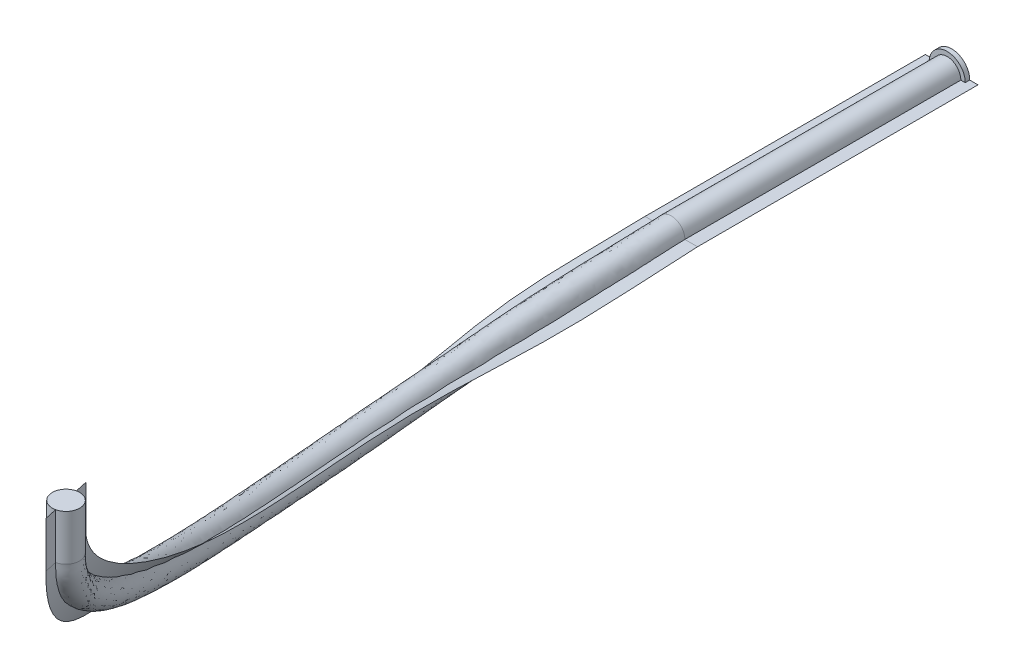
ISO-10303-21;
HEADER;
FILE_DESCRIPTION(('STEP AP214'),'2;1');
FILE_NAME('part.step','',(''),(''),'','','');
FILE_SCHEMA(('AUTOMOTIVE_DESIGN { 1 0 10303 214 1 1 1 1 }'));
ENDSEC;
DATA;
#1=APPLICATION_CONTEXT('core data for automotive mechanical design processes');
#2=APPLICATION_PROTOCOL_DEFINITION('international standard','automotive_design',2000,#1);
#3=PRODUCT_CONTEXT('',#1,'mechanical');
#4=PRODUCT('Part','Part','',(#3));
#5=PRODUCT_RELATED_PRODUCT_CATEGORY('part','',(#4));
#6=PRODUCT_DEFINITION_FORMATION('','',#4);
#7=PRODUCT_DEFINITION_CONTEXT('part definition',#1,'design');
#8=PRODUCT_DEFINITION('design','',#6,#7);
#9=PRODUCT_DEFINITION_SHAPE('','',#8);
#10=(LENGTH_UNIT() NAMED_UNIT(*) SI_UNIT(.MILLI.,.METRE.));
#11=(NAMED_UNIT(*) PLANE_ANGLE_UNIT() SI_UNIT($,.RADIAN.));
#12=(NAMED_UNIT(*) SI_UNIT($,.STERADIAN.) SOLID_ANGLE_UNIT());
#13=UNCERTAINTY_MEASURE_WITH_UNIT(LENGTH_MEASURE(1.E-05),#10,'distance_accuracy_value','');
#14=(GEOMETRIC_REPRESENTATION_CONTEXT(3) GLOBAL_UNCERTAINTY_ASSIGNED_CONTEXT((#13)) GLOBAL_UNIT_ASSIGNED_CONTEXT((#10,
#11,#12)) REPRESENTATION_CONTEXT('',''));
#15=CARTESIAN_POINT('',(0.,0.,0.));
#16=DIRECTION('',(0.,0.,1.));
#17=DIRECTION('',(1.,0.,0.));
#18=AXIS2_PLACEMENT_3D('',#15,#16,#17);
#19=CARTESIAN_POINT('',(-395.549654156341,-1278.63868879363,-202.079208570186));
#20=DIRECTION('',(0.,0.,-1.));
#21=DIRECTION('',(-1.,0.,0.));
#22=AXIS2_PLACEMENT_3D('',#19,#20,#21);
#23=CYLINDRICAL_SURFACE('',#22,15.0993824413652);
#24=CARTESIAN_POINT('',(-395.549654156341,-1278.63868879363,-202.079208570186));
#25=DIRECTION('',(0.,0.,-1.));
#26=DIRECTION('',(-1.,0.,0.));
#27=AXIS2_PLACEMENT_3D('',#24,#25,#26);
#28=CIRCLE('',#27,15.0993824413652);
#29=CARTESIAN_POINT('',(-410.649036597706,-1278.63868879363,-202.079208570186));
#30=VERTEX_POINT('',#29);
#31=EDGE_CURVE('E222',#30,#30,#28,.T.);
#32=ORIENTED_EDGE('',*,*,#31,.T.);
#33=EDGE_LOOP('',(#32));
#34=FACE_BOUND('',#33,.T.);
#35=CARTESIAN_POINT('',(-395.549654156341,-1278.63868879363,-507.499999999996));
#36=DIRECTION('',(0.,0.,-1.));
#37=DIRECTION('',(-1.,0.,0.));
#38=AXIS2_PLACEMENT_3D('',#35,#36,#37);
#39=CIRCLE('',#38,15.0993824413652);
#40=CARTESIAN_POINT('',(-410.649036597706,-1278.63868879363,-507.499999999996));
#41=VERTEX_POINT('',#40);
#42=EDGE_CURVE('E214',#41,#41,#39,.F.);
#43=ORIENTED_EDGE('',*,*,#42,.T.);
#44=EDGE_LOOP('',(#43));
#45=FACE_BOUND('',#44,.T.);
#46=ADVANCED_FACE('F210',(#34,#45),#23,.T.);
#47=CARTESIAN_POINT('',(-200.,-1056.28406497572,663.359326446926));
#48=DIRECTION('',(0.,1.,0.));
#49=DIRECTION('',(0.,0.,1.));
#50=AXIS2_PLACEMENT_3D('',#47,#48,#49);
#51=CYLINDRICAL_SURFACE('',#50,15.0993824413652);
#52=CARTESIAN_POINT('',(-200.,-1056.28406497572,663.359326446926));
#53=DIRECTION('',(0.,-1.,0.));
#54=DIRECTION('',(0.215741497015158,0.,0.976450514089505));
#55=AXIS2_PLACEMENT_3D('',#52,#53,#54);
#56=CIRCLE('',#55,15.0993824413652);
#57=CARTESIAN_POINT('',(-196.742436628095,-1056.28406497572,678.103126194231));
#58=VERTEX_POINT('',#57);
#59=EDGE_CURVE('E218',#58,#58,#56,.T.);
#60=ORIENTED_EDGE('',*,*,#59,.F.);
#61=EDGE_LOOP('',(#60));
#62=FACE_BOUND('',#61,.T.);
#63=CARTESIAN_POINT('',(-200.,-1005.68587274389,663.359326446926));
#64=DIRECTION('',(0.,-1.,0.));
#65=DIRECTION('',(0.215741497015158,0.,0.976450514089505));
#66=AXIS2_PLACEMENT_3D('',#63,#64,#65);
#67=CIRCLE('',#66,15.0993824413652);
#68=CARTESIAN_POINT('',(-196.742436628095,-1005.68587274389,678.103126194231));
#69=VERTEX_POINT('',#68);
#70=EDGE_CURVE('E12',#69,#69,#67,.T.);
#71=ORIENTED_EDGE('',*,*,#70,.T.);
#72=EDGE_LOOP('',(#71));
#73=FACE_BOUND('',#72,.T.);
#74=ADVANCED_FACE('F212',(#62,#73),#51,.T.);
#75=CARTESIAN_POINT('',(-200.,-1005.68587274389,663.359326446926));
#76=DIRECTION('',(0.,-1.,0.));
#77=DIRECTION('',(0.215741497015158,0.,0.976450514089505));
#78=AXIS2_PLACEMENT_3D('',#75,#76,#77);
#79=PLANE('',#78);
#80=ORIENTED_EDGE('',*,*,#70,.F.);
#81=EDGE_LOOP('',(#80));
#82=FACE_BOUND('',#81,.T.);
#83=ADVANCED_FACE('F257',(#82),#79,.F.);
#84=CARTESIAN_POINT('',(-410.649036597706,-1278.63868879363,-202.079208570186));
#85=CARTESIAN_POINT('',(-410.097315987383,-1280.13529031759,-154.089244694451));
#86=CARTESIAN_POINT('',(-411.506472016958,-1280.1552318921,-49.0596444215387));
#87=CARTESIAN_POINT('',(-398.50447600819,-1298.07476062445,124.576906142));
#88=CARTESIAN_POINT('',(-375.20245834636,-1284.64911506825,268.0349973007));
#89=CARTESIAN_POINT('',(-345.63481387427,-1261.60789046633,372.806332066483));
#90=CARTESIAN_POINT('',(-313.492238632224,-1234.4574510709,461.081620574621));
#91=CARTESIAN_POINT('',(-274.818624715717,-1198.73693889181,542.066763861157));
#92=CARTESIAN_POINT('',(-239.760095591413,-1157.89476384902,606.325694608346));
#93=CARTESIAN_POINT('',(-222.614397804905,-1132.88806918285,635.876124706435));
#94=CARTESIAN_POINT('',(-212.700761895088,-1114.68526563084,652.521845365742));
#95=CARTESIAN_POINT('',(-207.520550833014,-1103.61290047056,661.092769625971));
#96=CARTESIAN_POINT('',(-203.173473744256,-1092.41633663636,668.18258746711));
#97=CARTESIAN_POINT('',(-199.788786505172,-1080.67093474105,673.578985251158));
#98=CARTESIAN_POINT('',(-197.385009109556,-1069.39690501262,677.372556943658));
#99=CARTESIAN_POINT('',(-196.93130002054,-1059.24870568145,677.782323796647));
#100=CARTESIAN_POINT('',(-196.742436628096,-1056.28406497572,678.103126194232));
#101=CARTESIAN_POINT('',(-410.649036597706,-1248.4399239109,-202.079208570186));
#102=CARTESIAN_POINT('',(-410.104007079352,-1249.92818417982,-154.538631349703));
#103=CARTESIAN_POINT('',(-406.102503342661,-1248.72645305673,-47.2058905795598));
#104=CARTESIAN_POINT('',(-417.3082346699,-1272.31833705188,125.485425188733));
#105=CARTESIAN_POINT('',(-391.212590304819,-1259.13845303554,267.795263694235));
#106=CARTESIAN_POINT('',(-363.446655943861,-1237.26148657585,371.760190623816));
#107=CARTESIAN_POINT('',(-334.238742572432,-1212.26045363335,460.266684732589));
#108=CARTESIAN_POINT('',(-299.9545968603,-1181.50860940214,544.27976729193));
#109=CARTESIAN_POINT('',(-267.084855539762,-1145.86214905849,611.434069518361));
#110=CARTESIAN_POINT('',(-250.63360103847,-1123.40894916784,642.107510480947));
#111=CARTESIAN_POINT('',(-241.13955131778,-1106.94246492553,659.123997122216));
#112=CARTESIAN_POINT('',(-236.204485520509,-1096.91018354365,667.7897183919));
#113=CARTESIAN_POINT('',(-232.134818792351,-1086.99991406038,674.822471932975));
#114=CARTESIAN_POINT('',(-228.958537978817,-1076.27148635968,680.142800007168));
#115=CARTESIAN_POINT('',(-227.016884530892,-1068.2617568406,683.556938611044));
#116=CARTESIAN_POINT('',(-226.055714917341,-1055.94230587065,684.595432833778));
#117=CARTESIAN_POINT('',(-226.230036122706,-1056.28406497572,684.618252938041));
#118=CARTESIAN_POINT('',(-380.450271714976,-1248.4399239109,-202.079208570186));
#119=CARTESIAN_POINT('',(-379.905242196622,-1249.92818417982,-154.538631349703));
#120=CARTESIAN_POINT('',(-374.628262979937,-1254.10004605205,-47.9901106517684));
#121=CARTESIAN_POINT('',(-391.653927070769,-1253.41066650787,122.837555578439));
#122=CARTESIAN_POINT('',(-366.358266517032,-1243.46268040857,260.485522978219));
#123=CARTESIAN_POINT('',(-340.696796115815,-1221.13419663584,360.13294235751));
#124=CARTESIAN_POINT('',(-314.697274974327,-1194.43606512032,445.127658475559));
#125=CARTESIAN_POINT('',(-286.833003608959,-1160.03458975854,526.833708365187));
#126=CARTESIAN_POINT('',(-260.899257941674,-1123.45539395261,591.931789432387));
#127=CARTESIAN_POINT('',(-248.137550985521,-1101.91202798128,620.902706016271));
#128=CARTESIAN_POINT('',(-241.171294973547,-1087.35612864143,636.092288429508));
#129=CARTESIAN_POINT('',(-237.749115567582,-1079.04546746817,643.450120932255));
#130=CARTESIAN_POINT('',(-235.191248306007,-1071.48327421874,648.961221838681));
#131=CARTESIAN_POINT('',(-233.521310868403,-1064.66825023733,652.633855533596));
#132=CARTESIAN_POINT('',(-232.844622326277,-1060.24073923852,654.525662687526));
#133=CARTESIAN_POINT('',(-232.57084166115,-1055.94230587065,655.107833339168));
#134=CARTESIAN_POINT('',(-232.745162866515,-1056.28406497572,655.13065344343));
#135=CARTESIAN_POINT('',(-380.450271714976,-1278.63868879363,-202.079208570186));
#136=CARTESIAN_POINT('',(-379.901896650637,-1280.13111969007,-154.313938022077));
#137=CARTESIAN_POINT('',(-380.030676897423,-1285.53075434968,-49.7394999796074));
#138=CARTESIAN_POINT('',(-372.850591738923,-1279.16659290381,121.900800723655));
#139=CARTESIAN_POINT('',(-350.3481139882,-1268.97328484226,260.726104590143));
#140=CARTESIAN_POINT('',(-322.884937915835,-1245.48072546519,361.180839055956));
#141=CARTESIAN_POINT('',(-293.950792067873,-1216.63309570696,445.941562181892));
#142=CARTESIAN_POINT('',(-261.696950022076,-1177.26220315087,524.62093421011));
#143=CARTESIAN_POINT('',(-233.574635343558,-1135.48925424508,586.823270281896));
#144=CARTESIAN_POINT('',(-220.117971763413,-1111.38772542209,614.671631239071));
#145=CARTESIAN_POINT('',(-212.732924351234,-1095.10274201075,629.489792695192));
#146=CARTESIAN_POINT('',(-209.063563751541,-1085.73346221793,636.754499070443));
#147=CARTESIAN_POINT('',(-206.235952971716,-1076.95477283927,642.316373734187));
#148=CARTESIAN_POINT('',(-204.328977668091,-1068.86211661762,646.088568427986));
#149=CARTESIAN_POINT('',(-203.297024097805,-1062.14313937031,648.272134057171));
#150=CARTESIAN_POINT('',(-203.264834465445,-1057.59550577605,648.443715448698));
#151=CARTESIAN_POINT('',(-203.257563371905,-1056.28406497572,648.615526699621));
#152=CARTESIAN_POINT('',(-380.450271714976,-1308.83745367636,-202.079208570186));
#153=CARTESIAN_POINT('',(-379.898551104653,-1310.33405520032,-154.089244694451));
#154=CARTESIAN_POINT('',(-385.433090814909,-1316.96146264732,-51.4888893074463));
#155=CARTESIAN_POINT('',(-354.047256407076,-1304.92251929975,120.96404586887));
#156=CARTESIAN_POINT('',(-334.337961459367,-1294.48388927595,260.966686202066));
#157=CARTESIAN_POINT('',(-305.073079715854,-1269.82725429453,362.228735754401));
#158=CARTESIAN_POINT('',(-273.204309161419,-1238.8301262936,446.755465888225));
#159=CARTESIAN_POINT('',(-236.560896435193,-1194.48981654321,522.408160055032));
#160=CARTESIAN_POINT('',(-206.250012745441,-1147.52311453756,581.714751131406));
#161=CARTESIAN_POINT('',(-192.098392541305,-1120.8634228629,608.440556461871));
#162=CARTESIAN_POINT('',(-184.294553728921,-1102.84935538008,622.887296960877));
#163=CARTESIAN_POINT('',(-180.378011935501,-1092.42145696769,630.058877208632));
#164=CARTESIAN_POINT('',(-177.280657637424,-1082.4262714598,635.671525629692));
#165=CARTESIAN_POINT('',(-175.136644467781,-1073.05598299791,639.543281322376));
#166=CARTESIAN_POINT('',(-173.749425869333,-1064.04553950209,642.018605426817));
#167=CARTESIAN_POINT('',(-173.958827269739,-1059.24870568145,641.779597558228));
#168=CARTESIAN_POINT('',(-173.769963877294,-1056.28406497572,642.100399955812));
#169=CARTESIAN_POINT('',(-410.649036597706,-1308.83745367636,-202.079208570186));
#170=CARTESIAN_POINT('',(-410.090624895415,-1310.34239645535,-153.639858039199));
#171=CARTESIAN_POINT('',(-416.910440691255,-1311.58401072748,-50.9133982635177));
#172=CARTESIAN_POINT('',(-379.70071734648,-1323.83118419702,123.668387095266));
#173=CARTESIAN_POINT('',(-359.1923263879,-1310.15977710095,268.274730907165));
#174=CARTESIAN_POINT('',(-327.82297180468,-1285.95429435681,373.85247350915));
#175=CARTESIAN_POINT('',(-292.745734692015,-1256.65444850844,461.896556416654));
#176=CARTESIAN_POINT('',(-249.682652571135,-1215.96526838147,539.853760430384));
#177=CARTESIAN_POINT('',(-212.435335643063,-1169.92737863955,601.217319698332));
#178=CARTESIAN_POINT('',(-194.59519457134,-1142.36718919787,629.644738931923));
#179=CARTESIAN_POINT('',(-184.261972472395,-1122.42806633615,645.919693609269));
#180=CARTESIAN_POINT('',(-178.83661614552,-1110.31561739747,654.395820860041));
#181=CARTESIAN_POINT('',(-174.212128696162,-1097.83275921233,661.542703001245));
#182=CARTESIAN_POINT('',(-170.619035031529,-1085.07038312242,667.015170495149));
#183=CARTESIAN_POINT('',(-167.753133688221,-1070.53205318463,671.188175276271));
#184=CARTESIAN_POINT('',(-167.806885123739,-1062.55510549225,670.969214759516));
#185=CARTESIAN_POINT('',(-167.254837133485,-1056.28406497572,671.587999450423));
#186=CARTESIAN_POINT('',(-410.649036597706,-1278.63868879363,-202.079208570186));
#187=CARTESIAN_POINT('',(-410.097315987383,-1280.13529031759,-154.089244694451));
#188=CARTESIAN_POINT('',(-411.506472016958,-1280.1552318921,-49.0596444215387));
#189=CARTESIAN_POINT('',(-398.50447600819,-1298.07476062445,124.576906142));
#190=CARTESIAN_POINT('',(-375.20245834636,-1284.64911506825,268.0349973007));
#191=CARTESIAN_POINT('',(-345.63481387427,-1261.60789046633,372.806332066483));
#192=CARTESIAN_POINT('',(-313.492238632224,-1234.4574510709,461.081620574621));
#193=CARTESIAN_POINT('',(-274.818624715717,-1198.73693889181,542.066763861157));
#194=CARTESIAN_POINT('',(-239.760095591413,-1157.89476384902,606.325694608346));
#195=CARTESIAN_POINT('',(-222.614397804905,-1132.88806918285,635.876124706435));
#196=CARTESIAN_POINT('',(-212.700761895088,-1114.68526563084,652.521845365742));
#197=CARTESIAN_POINT('',(-207.520550833014,-1103.61290047056,661.092769625971));
#198=CARTESIAN_POINT('',(-203.173473744256,-1092.41633663636,668.18258746711));
#199=CARTESIAN_POINT('',(-199.788786505172,-1080.67093474105,673.578985251158));
#200=CARTESIAN_POINT('',(-197.385009109556,-1069.39690501262,677.372556943658));
#201=CARTESIAN_POINT('',(-196.93130002054,-1059.24870568145,677.782323796647));
#202=CARTESIAN_POINT('',(-196.742436628096,-1056.28406497572,678.103126194232));
#203=(BOUNDED_SURFACE() B_SPLINE_SURFACE(3,3,((#84,#85,#86,#87,#88,#89,#90,#91,#92,#93,#94,#95,
#96,#97,#98,#99,#100),(#101,#102,#103,#104,#105,#106,#107,#108,#109,#110,#111,#112,#113,#114,
#115,#116,#117),(#118,#119,#120,#121,#122,#123,#124,#125,#126,#127,#128,#129,#130,#131,#132,
#133,#134),(#135,#136,#137,#138,#139,#140,#141,#142,#143,#144,#145,#146,#147,#148,#149,#150,
#151),(#152,#153,#154,#155,#156,#157,#158,#159,#160,#161,#162,#163,#164,#165,#166,#167,#168),
(#169,#170,#171,#172,#173,#174,#175,#176,#177,#178,#179,#180,#181,#182,#183,#184,#185),(#186,
#187,#188,#189,#190,#191,#192,#193,#194,#195,#196,#197,#198,#199,#200,#201,#202)),.UNSPECIFIED.,
.T.,.F.,.F.) B_SPLINE_SURFACE_WITH_KNOTS((4,3,4),(4,1,1,1,1,1,1,1,1,1,1,1,1,1,4),(0.,0.5,1.),
(0.,0.166666666666667,0.333333333333333,0.5,0.561671255590079,0.625,0.75,0.8125,0.875,
0.895833333333333,0.916666666666667,0.937500000000001,0.958333333333329,0.979166666666667,1.),
.UNSPECIFIED.) GEOMETRIC_REPRESENTATION_ITEM() RATIONAL_B_SPLINE_SURFACE(((1.,1.,1.,1.,1.,1.,1.,
1.,1.,1.,1.,1.,1.,1.,1.,1.,1.),(0.333333333333333,0.333333333333333,0.333333333333333,
0.333333333333333,0.333333333333333,0.333333333333333,0.333333333333333,0.333333333333333,
0.333333333333333,0.333333333333333,0.333333333333333,0.333333333333333,0.333333333333333,
0.333333333333333,0.333333333333333,0.333333333333333,0.333333333333333),(0.333333333333333,
0.333333333333333,0.333333333333333,0.333333333333333,0.333333333333333,0.333333333333333,
0.333333333333333,0.333333333333333,0.333333333333333,0.333333333333333,0.333333333333333,
0.333333333333333,0.333333333333333,0.333333333333333,0.333333333333333,0.333333333333333,
0.333333333333333),(1.,1.,1.,1.,1.,1.,1.,1.,1.,1.,1.,1.,1.,1.,1.,1.,1.),(0.333333333333333,
0.333333333333333,0.333333333333333,0.333333333333333,0.333333333333333,0.333333333333333,
0.333333333333333,0.333333333333333,0.333333333333333,0.333333333333333,0.333333333333333,
0.333333333333333,0.333333333333333,0.333333333333333,0.333333333333333,0.333333333333333,
0.333333333333333),(0.333333333333333,0.333333333333333,0.333333333333333,0.333333333333333,
0.333333333333333,0.333333333333333,0.333333333333333,0.333333333333333,0.333333333333333,
0.333333333333333,0.333333333333333,0.333333333333333,0.333333333333333,0.333333333333333,
0.333333333333333,0.333333333333333,0.333333333333333),(1.,1.,1.,1.,1.,1.,1.,1.,1.,1.,1.,1.,1.,
1.,1.,1.,1.))) REPRESENTATION_ITEM('') SURFACE());
#204=ORIENTED_EDGE('',*,*,#31,.F.);
#205=EDGE_LOOP('',(#204));
#206=FACE_BOUND('',#205,.T.);
#207=ORIENTED_EDGE('',*,*,#59,.T.);
#208=EDGE_LOOP('',(#207));
#209=FACE_BOUND('',#208,.T.);
#210=ADVANCED_FACE('F250',(#206,#209),#203,.F.);
#211=CARTESIAN_POINT('',(-395.549654156341,-1278.63868879363,-507.499999999996));
#212=DIRECTION('',(0.,0.,-1.));
#213=DIRECTION('',(-1.,0.,0.));
#214=AXIS2_PLACEMENT_3D('',#211,#212,#213);
#215=CYLINDRICAL_SURFACE('',#214,20.);
#216=CARTESIAN_POINT('',(-395.549654156341,-1278.63868879363,-507.499999999996));
#217=DIRECTION('',(0.,0.,-1.));
#218=DIRECTION('',(-1.,0.,0.));
#219=AXIS2_PLACEMENT_3D('',#216,#217,#218);
#220=CIRCLE('',#219,20.);
#221=CARTESIAN_POINT('',(-415.549654156341,-1278.63868879363,-507.499999999996));
#222=VERTEX_POINT('',#221);
#223=EDGE_CURVE('E230',#222,#222,#220,.T.);
#224=ORIENTED_EDGE('',*,*,#223,.T.);
#225=EDGE_LOOP('',(#224));
#226=FACE_BOUND('',#225,.T.);
#227=CARTESIAN_POINT('',(-395.549654156341,-1278.63868879363,-512.499999999996));
#228=DIRECTION('',(0.,0.,-1.));
#229=DIRECTION('',(-1.,0.,0.));
#230=AXIS2_PLACEMENT_3D('',#227,#228,#229);
#231=CIRCLE('',#230,20.);
#232=CARTESIAN_POINT('',(-415.549654156341,-1278.63868879363,-512.499999999996));
#233=VERTEX_POINT('',#232);
#234=EDGE_CURVE('E227',#233,#233,#231,.T.);
#235=ORIENTED_EDGE('',*,*,#234,.F.);
#236=EDGE_LOOP('',(#235));
#237=FACE_BOUND('',#236,.T.);
#238=ADVANCED_FACE('F242',(#226,#237),#215,.T.);
#239=CARTESIAN_POINT('',(-395.549654156341,-1278.63868879363,-507.499999999996));
#240=DIRECTION('',(0.,0.,-1.));
#241=DIRECTION('',(-1.,0.,0.));
#242=AXIS2_PLACEMENT_3D('',#239,#240,#241);
#243=PLANE('',#242);
#244=ORIENTED_EDGE('',*,*,#42,.F.);
#245=EDGE_LOOP('',(#244));
#246=FACE_BOUND('',#245,.T.);
#247=ORIENTED_EDGE('',*,*,#223,.F.);
#248=EDGE_LOOP('',(#247));
#249=FACE_BOUND('',#248,.T.);
#250=ADVANCED_FACE('F238',(#246,#249),#243,.F.);
#251=CARTESIAN_POINT('',(-395.549654156341,-1278.63868879363,-512.499999999996));
#252=DIRECTION('',(0.,0.,-1.));
#253=DIRECTION('',(-1.,0.,0.));
#254=AXIS2_PLACEMENT_3D('',#251,#252,#253);
#255=PLANE('',#254);
#256=ORIENTED_EDGE('',*,*,#234,.T.);
#257=EDGE_LOOP('',(#256));
#258=FACE_BOUND('',#257,.T.);
#259=ADVANCED_FACE('F241',(#258),#255,.T.);
#260=CLOSED_SHELL('',(#46,#74,#83,#210,#238,#250,#259));
#261=MANIFOLD_SOLID_BREP('B2',#260);
#262=CARTESIAN_POINT('',(-366.445169002347,-1278.63868879363,-512.499999999996));
#263=DIRECTION('',(0.,1.,0.));
#264=DIRECTION('',(0.,0.,1.));
#265=AXIS2_PLACEMENT_3D('',#262,#263,#264);
#266=PLANE('',#265);
#267=DIRECTION('',(-1.,0.,0.));
#268=VECTOR('',#267,1.);
#269=CARTESIAN_POINT('',(-366.445169002347,-1278.63868879363,-202.079208570186));
#270=LINE('',#269,#268);
#271=CARTESIAN_POINT('',(-366.445169002347,-1278.63868879363,-202.079208570186));
#272=VERTEX_POINT('',#271);
#273=CARTESIAN_POINT('',(-424.654139310334,-1278.63868879363,-202.079208570186));
#274=VERTEX_POINT('',#273);
#275=EDGE_CURVE('E363',#272,#274,#270,.T.);
#276=ORIENTED_EDGE('',*,*,#275,.F.);
#277=DIRECTION('',(0.,0.,1.));
#278=VECTOR('',#277,1.);
#279=CARTESIAN_POINT('',(-366.445169002347,-1278.63868879363,-512.499999999996));
#280=LINE('',#279,#278);
#281=CARTESIAN_POINT('',(-366.445169002347,-1278.63868879363,-512.499999999996));
#282=VERTEX_POINT('',#281);
#283=EDGE_CURVE('E358',#282,#272,#280,.T.);
#284=ORIENTED_EDGE('',*,*,#283,.F.);
#285=DIRECTION('',(-1.,0.,0.));
#286=VECTOR('',#285,1.);
#287=CARTESIAN_POINT('',(-366.445169002347,-1278.63868879363,-512.499999999996));
#288=LINE('',#287,#286);
#289=CARTESIAN_POINT('',(-424.654139310334,-1278.63868879363,-512.499999999996));
#290=VERTEX_POINT('',#289);
#291=EDGE_CURVE('E360',#282,#290,#288,.T.);
#292=ORIENTED_EDGE('',*,*,#291,.T.);
#293=DIRECTION('',(0.,0.,1.));
#294=VECTOR('',#293,1.);
#295=CARTESIAN_POINT('',(-424.654139310334,-1278.63868879363,-512.499999999996));
#296=LINE('',#295,#294);
#297=EDGE_CURVE('E367',#290,#274,#296,.T.);
#298=ORIENTED_EDGE('',*,*,#297,.T.);
#299=EDGE_LOOP('',(#276,#284,#292,#298));
#300=FACE_BOUND('',#299,.T.);
#301=ADVANCED_FACE('F320',(#300),#266,.T.);
#302=CARTESIAN_POINT('',(-366.445169002347,-1278.63868879363,-202.079208570186));
#303=CARTESIAN_POINT('',(-365.897747481466,-1280.12993098288,-154.377979841666));
#304=CARTESIAN_POINT('',(-365.433611324697,-1288.02338374777,-50.0734472405138));
#305=CARTESIAN_POINT('',(-360.95316577958,-1270.39775257673,120.664766147855));
#306=CARTESIAN_POINT('',(-338.82156527317,-1261.70340799927,257.336351036896));
#307=CARTESIAN_POINT('',(-312.334365279349,-1238.00150313317,355.789039126299));
#308=CARTESIAN_POINT('',(-284.8881671265,-1208.3667938379,438.920331269421));
#309=CARTESIAN_POINT('',(-255.611603056946,-1167.30311987268,516.530143917092));
#310=CARTESIAN_POINT('',(-230.70601645025,-1125.09816084674,577.778771995161));
#311=CARTESIAN_POINT('',(-218.960286218408,-1101.41724983392,604.837693034599));
#312=CARTESIAN_POINT('',(-212.747765284837,-1086.02038926991,618.808415233808));
#313=CARTESIAN_POINT('',(-209.779446787573,-1077.44425232839,625.467045998088));
#314=CARTESIAN_POINT('',(-207.655139505617,-1069.77441019184,630.321439889684));
#315=CARTESIAN_POINT('',(-206.438591668421,-1063.42235764469,633.336188557901));
#316=CARTESIAN_POINT('',(-206.023740196035,-1058.64196066439,634.788762615728));
#317=CARTESIAN_POINT('',(-206.234559073835,-1057.12431274506,634.810890980905));
#318=CARTESIAN_POINT('',(-206.279045196978,-1056.28406497572,634.940236955999));
#319=CARTESIAN_POINT('',(-424.654139310334,-1278.63868879363,-202.079208570186));
#320=CARTESIAN_POINT('',(-424.098119610571,-1280.1406496523,-153.800509547237));
#321=CARTESIAN_POINT('',(-426.105092346496,-1277.66067303176,-48.8300616747724));
#322=CARTESIAN_POINT('',(-410.401478637671,-1306.84409812816,125.841176525851));
#323=CARTESIAN_POINT('',(-386.729027631762,-1291.91904951025,271.423902848489));
#324=CARTESIAN_POINT('',(-356.185402641147,-1269.08698785949,378.196376740361));
#325=CARTESIAN_POINT('',(-322.554842539843,-1242.72371979086,468.103883622793));
#326=CARTESIAN_POINT('',(-280.904053123147,-1208.69673826733,550.157324878479));
#327=CARTESIAN_POINT('',(-242.628577134488,-1168.28461174543,615.370337135557));
#328=CARTESIAN_POINT('',(-223.772459338454,-1142.86196734523,645.709751913597));
#329=CARTESIAN_POINT('',(-212.685502161105,-1123.76380570768,663.203566804969));
#330=CARTESIAN_POINT('',(-206.806284925528,-1111.91683253724,672.378895794208));
#331=CARTESIAN_POINT('',(-201.748237496552,-1099.54162323923,680.182484950241));
#332=CARTESIAN_POINT('',(-197.70175423151,-1086.31627571506,686.312837470844));
#333=CARTESIAN_POINT('',(-194.574015818463,-1072.13083175877,690.925075348071));
#334=CARTESIAN_POINT('',(-194.143167711054,-1061.37309861783,691.266157117778));
#335=CARTESIAN_POINT('',(-193.720954803022,-1056.28406497572,691.778415937854));
#336=B_SPLINE_SURFACE_WITH_KNOTS('',1,3,((#302,#303,#304,#305,#306,#307,#308,#309,#310,#311,
#312,#313,#314,#315,#316,#317,#318),(#319,#320,#321,#322,#323,#324,#325,#326,#327,#328,#329,
#330,#331,#332,#333,#334,#335)),.UNSPECIFIED.,.F.,.F.,.F.,(2,2),(4,1,1,1,1,1,1,1,1,1,1,1,1,1,4),
(0.,1.),(0.,0.166666666666667,0.333333333333333,0.5,0.561671255590079,0.625,0.75,0.8125,0.875,
0.895833333333333,0.916666666666667,0.937500000000001,0.958333333333329,0.979166666666667,1.),.UNSPECIFIED.);
#337=CARTESIAN_POINT('',(-424.654139310334,-1278.63868879363,-202.079208570186));
#338=CARTESIAN_POINT('',(-424.098119610571,-1280.1406496523,-153.800509547237));
#339=CARTESIAN_POINT('',(-426.105092346496,-1277.66067303176,-48.8300616747724));
#340=CARTESIAN_POINT('',(-410.401478637671,-1306.84409812816,125.841176525851));
#341=CARTESIAN_POINT('',(-386.729027631762,-1291.91904951025,271.423902848489));
#342=CARTESIAN_POINT('',(-356.185402641147,-1269.08698785949,378.196376740361));
#343=CARTESIAN_POINT('',(-322.554842539843,-1242.72371979086,468.103883622793));
#344=CARTESIAN_POINT('',(-280.904053123147,-1208.69673826733,550.157324878479));
#345=CARTESIAN_POINT('',(-242.628577134488,-1168.28461174543,615.370337135557));
#346=CARTESIAN_POINT('',(-223.772459338454,-1142.86196734523,645.709751913597));
#347=CARTESIAN_POINT('',(-212.685502161105,-1123.76380570768,663.203566804969));
#348=CARTESIAN_POINT('',(-206.806284925528,-1111.91683253724,672.378895794208));
#349=CARTESIAN_POINT('',(-201.748237496552,-1099.54162323923,680.182484950241));
#350=CARTESIAN_POINT('',(-197.70175423151,-1086.31627571506,686.312837470844));
#351=CARTESIAN_POINT('',(-194.574015818463,-1072.13083175877,690.925075348071));
#352=CARTESIAN_POINT('',(-194.143167711054,-1061.37309861783,691.266157117778));
#353=CARTESIAN_POINT('',(-193.720954803022,-1056.28406497572,691.778415937854));
#354=B_SPLINE_CURVE_WITH_KNOTS('',3,(#337,#338,#339,#340,#341,#342,#343,#344,#345,#346,#347,
#348,#349,#350,#351,#352,#353),.UNSPECIFIED.,.F.,.F.,(4,1,1,1,1,1,1,1,1,1,1,1,1,1,4),(0.,
0.166666666666667,0.333333333333333,0.5,0.561671255590079,0.625,0.75,0.8125,0.875,
0.895833333333333,0.916666666666667,0.937500000000001,0.958333333333329,0.979166666666667,1.),.UNSPECIFIED.);
#355=CARTESIAN_POINT('',(-193.720954803022,-1056.28406497572,691.778415937854));
#356=VERTEX_POINT('',#355);
#357=EDGE_CURVE('E376',#274,#356,#354,.T.);
#358=DIRECTION('',(-0.21574149701516,0.,-0.976450514089505));
#359=VECTOR('',#358,1.);
#360=CARTESIAN_POINT('',(-200.,-1056.28406497572,663.359326446926));
#361=LINE('',#360,#359);
#362=CARTESIAN_POINT('',(-206.279045196978,-1056.28406497572,634.940236955999));
#363=VERTEX_POINT('',#362);
#364=EDGE_CURVE('E323',#356,#363,#361,.T.);
#365=CARTESIAN_POINT('',(-366.445169002347,-1278.63868879363,-202.079208570186));
#366=CARTESIAN_POINT('',(-365.897747481466,-1280.12993098288,-154.377979841666));
#367=CARTESIAN_POINT('',(-365.433611324697,-1288.02338374777,-50.0734472405138));
#368=CARTESIAN_POINT('',(-360.95316577958,-1270.39775257673,120.664766147855));
#369=CARTESIAN_POINT('',(-338.82156527317,-1261.70340799927,257.336351036896));
#370=CARTESIAN_POINT('',(-312.334365279349,-1238.00150313317,355.789039126299));
#371=CARTESIAN_POINT('',(-284.8881671265,-1208.3667938379,438.920331269421));
#372=CARTESIAN_POINT('',(-255.611603056946,-1167.30311987268,516.530143917092));
#373=CARTESIAN_POINT('',(-230.70601645025,-1125.09816084674,577.778771995161));
#374=CARTESIAN_POINT('',(-218.960286218408,-1101.41724983392,604.837693034599));
#375=CARTESIAN_POINT('',(-212.747765284837,-1086.02038926991,618.808415233808));
#376=CARTESIAN_POINT('',(-209.779446787573,-1077.44425232839,625.467045998088));
#377=CARTESIAN_POINT('',(-207.655139505617,-1069.77441019184,630.321439889684));
#378=CARTESIAN_POINT('',(-206.438591668421,-1063.42235764469,633.336188557901));
#379=CARTESIAN_POINT('',(-206.023740196035,-1058.64196066439,634.788762615728));
#380=CARTESIAN_POINT('',(-206.234559073835,-1057.12431274506,634.810890980905));
#381=CARTESIAN_POINT('',(-206.279045196978,-1056.28406497572,634.940236955999));
#382=B_SPLINE_CURVE_WITH_KNOTS('',3,(#365,#366,#367,#368,#369,#370,#371,#372,#373,#374,#375,
#376,#377,#378,#379,#380,#381),.UNSPECIFIED.,.F.,.F.,(4,1,1,1,1,1,1,1,1,1,1,1,1,1,4),(0.,
0.166666666666667,0.333333333333333,0.5,0.561671255590079,0.625,0.75,0.8125,0.875,
0.895833333333333,0.916666666666667,0.937500000000001,0.958333333333329,0.979166666666667,1.),.UNSPECIFIED.);
#383=EDGE_CURVE('E372',#363,#272,#382,.F.);
#384=ORIENTED_EDGE('',*,*,#275,.T.);
#385=ORIENTED_EDGE('',*,*,#357,.T.);
#386=ORIENTED_EDGE('',*,*,#364,.T.);
#387=ORIENTED_EDGE('',*,*,#383,.T.);
#388=EDGE_LOOP('',(#384,#385,#386,#387));
#389=FACE_BOUND('',#388,.T.);
#390=ADVANCED_FACE('F409',(#389),#336,.T.);
#391=CARTESIAN_POINT('',(-206.279045196978,-1056.28406497572,634.940236955999));
#392=DIRECTION('',(-0.976450514089505,0.,0.21574149701516));
#393=DIRECTION('',(0.21574149701516,0.,0.976450514089505));
#394=AXIS2_PLACEMENT_3D('',#391,#392,#393);
#395=PLANE('',#394);
#396=DIRECTION('',(0.21574149701516,0.,0.976450514089505));
#397=VECTOR('',#396,1.);
#398=CARTESIAN_POINT('',(-200.,-1005.68587274389,663.359326446926));
#399=LINE('',#398,#397);
#400=CARTESIAN_POINT('',(-206.279045196978,-1005.68587274389,634.940236955999));
#401=VERTEX_POINT('',#400);
#402=CARTESIAN_POINT('',(-193.720954803022,-1005.68587274389,691.778415937854));
#403=VERTEX_POINT('',#402);
#404=EDGE_CURVE('E335',#401,#403,#399,.T.);
#405=ORIENTED_EDGE('',*,*,#404,.F.);
#406=DIRECTION('',(0.,1.,0.));
#407=VECTOR('',#406,1.);
#408=CARTESIAN_POINT('',(-206.279045196978,-1056.28406497572,634.940236955999));
#409=LINE('',#408,#407);
#410=EDGE_CURVE('E328',#363,#401,#409,.T.);
#411=ORIENTED_EDGE('',*,*,#410,.F.);
#412=ORIENTED_EDGE('',*,*,#364,.F.);
#413=DIRECTION('',(0.,1.,0.));
#414=VECTOR('',#413,1.);
#415=CARTESIAN_POINT('',(-193.720954803022,-1056.28406497572,691.778415937854));
#416=LINE('',#415,#414);
#417=EDGE_CURVE('E208',#356,#403,#416,.T.);
#418=ORIENTED_EDGE('',*,*,#417,.T.);
#419=EDGE_LOOP('',(#405,#411,#412,#418));
#420=FACE_BOUND('',#419,.T.);
#421=ADVANCED_FACE('F321',(#420),#395,.T.);
#422=OPEN_SHELL('',(#301,#390,#421));
#423=SHELL_BASED_SURFACE_MODEL('B7',(#422));
#424=ADVANCED_BREP_SHAPE_REPRESENTATION('',(#18,#261),#14);
#425=MANIFOLD_SURFACE_SHAPE_REPRESENTATION('',(#18,#423),#14);
#426=SHAPE_REPRESENTATION('',(#18),#14);
#427=SHAPE_DEFINITION_REPRESENTATION(#9,#426);
#428=SHAPE_REPRESENTATION_RELATIONSHIP('','',#426,#424);
#429=SHAPE_REPRESENTATION_RELATIONSHIP('','',#426,#425);
ENDSEC;
END-ISO-10303-21;
